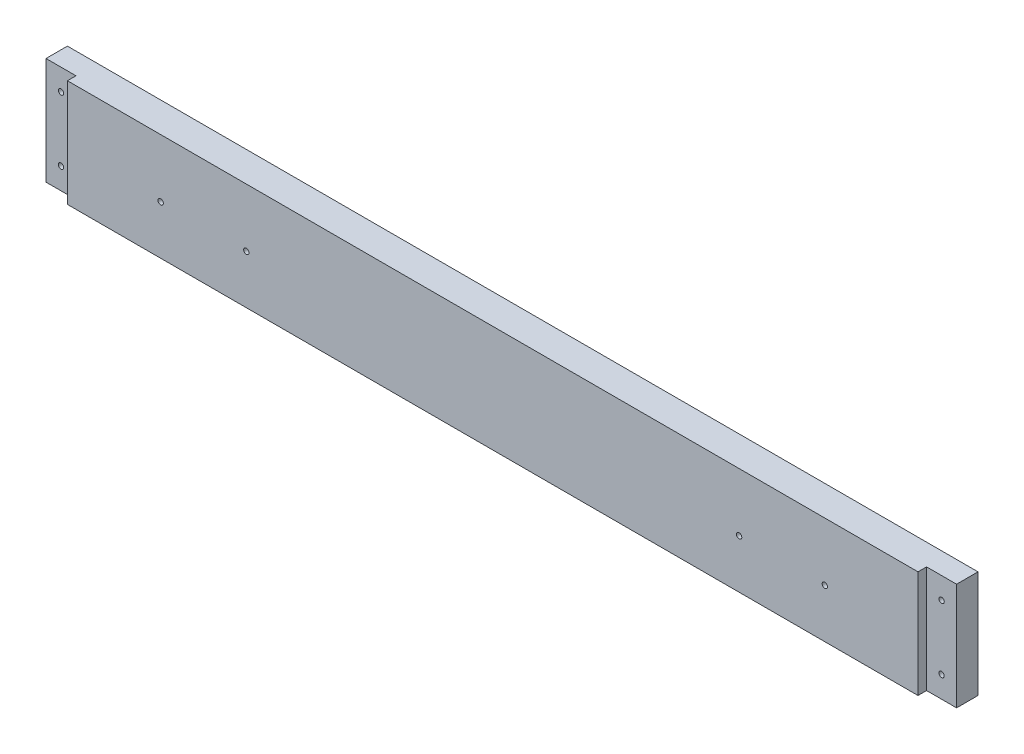
ISO-10303-21;
HEADER;
FILE_DESCRIPTION(('STEP AP214'),'2;1');
FILE_NAME('part.step','',(''),(''),'','','');
FILE_SCHEMA(('AUTOMOTIVE_DESIGN { 1 0 10303 214 1 1 1 1 }'));
ENDSEC;
DATA;
#1=APPLICATION_CONTEXT('core data for automotive mechanical design processes');
#2=APPLICATION_PROTOCOL_DEFINITION('international standard','automotive_design',2000,#1);
#3=PRODUCT_CONTEXT('',#1,'mechanical');
#4=PRODUCT('Part','Part','',(#3));
#5=PRODUCT_RELATED_PRODUCT_CATEGORY('part','',(#4));
#6=PRODUCT_DEFINITION_FORMATION('','',#4);
#7=PRODUCT_DEFINITION_CONTEXT('part definition',#1,'design');
#8=PRODUCT_DEFINITION('design','',#6,#7);
#9=PRODUCT_DEFINITION_SHAPE('','',#8);
#10=(LENGTH_UNIT() NAMED_UNIT(*) SI_UNIT(.MILLI.,.METRE.));
#11=(NAMED_UNIT(*) PLANE_ANGLE_UNIT() SI_UNIT($,.RADIAN.));
#12=(NAMED_UNIT(*) SI_UNIT($,.STERADIAN.) SOLID_ANGLE_UNIT());
#13=UNCERTAINTY_MEASURE_WITH_UNIT(LENGTH_MEASURE(1.E-05),#10,'distance_accuracy_value','');
#14=(GEOMETRIC_REPRESENTATION_CONTEXT(3) GLOBAL_UNCERTAINTY_ASSIGNED_CONTEXT((#13)) GLOBAL_UNIT_ASSIGNED_CONTEXT((#10,
#11,#12)) REPRESENTATION_CONTEXT('',''));
#15=CARTESIAN_POINT('',(0.,0.,0.));
#16=DIRECTION('',(0.,0.,1.));
#17=DIRECTION('',(1.,0.,0.));
#18=AXIS2_PLACEMENT_3D('',#15,#16,#17);
#19=CARTESIAN_POINT('',(10838.3916666658,-5719.7625,-17.78));
#20=DIRECTION('',(0.,-1.,0.));
#21=DIRECTION('',(0.,0.,-1.));
#22=AXIS2_PLACEMENT_3D('',#19,#20,#21);
#23=PLANE('',#22);
#24=DIRECTION('',(0.,0.,1.));
#25=VECTOR('',#24,1.);
#26=CARTESIAN_POINT('',(10856.1716666658,-5719.7625,-5.08));
#27=LINE('',#26,#25);
#28=CARTESIAN_POINT('',(10856.1716666658,-5719.7625,-5.08));
#29=VERTEX_POINT('',#28);
#30=CARTESIAN_POINT('',(10856.1716666658,-5719.7625,0.));
#31=VERTEX_POINT('',#30);
#32=EDGE_CURVE('E47',#29,#31,#27,.T.);
#33=ORIENTED_EDGE('',*,*,#32,.F.);
#34=DIRECTION('',(1.,0.,0.));
#35=VECTOR('',#34,1.);
#36=CARTESIAN_POINT('',(10856.1716666658,-5719.7625,-5.08));
#37=LINE('',#36,#35);
#38=CARTESIAN_POINT('',(10838.3916666658,-5719.7625,-5.08));
#39=VERTEX_POINT('',#38);
#40=EDGE_CURVE('E114',#39,#29,#37,.T.);
#41=ORIENTED_EDGE('',*,*,#40,.F.);
#42=DIRECTION('',(0.,0.,1.));
#43=VECTOR('',#42,1.);
#44=CARTESIAN_POINT('',(10838.3916666658,-5719.7625,-17.78));
#45=LINE('',#44,#43);
#46=CARTESIAN_POINT('',(10838.3916666658,-5719.7625,-17.78));
#47=VERTEX_POINT('',#46);
#48=EDGE_CURVE('E11',#47,#39,#45,.T.);
#49=ORIENTED_EDGE('',*,*,#48,.F.);
#50=DIRECTION('',(1.,0.,0.));
#51=VECTOR('',#50,1.);
#52=CARTESIAN_POINT('',(10838.3916666658,-5719.7625,-17.78));
#53=LINE('',#52,#51);
#54=CARTESIAN_POINT('',(11378.1416666658,-5719.7625,-17.78));
#55=VERTEX_POINT('',#54);
#56=EDGE_CURVE('E178',#47,#55,#53,.T.);
#57=ORIENTED_EDGE('',*,*,#56,.T.);
#58=DIRECTION('',(0.,0.,1.));
#59=VECTOR('',#58,1.);
#60=CARTESIAN_POINT('',(11378.1416666658,-5719.7625,-17.78));
#61=LINE('',#60,#59);
#62=CARTESIAN_POINT('',(11378.1416666658,-5719.7625,-5.08));
#63=VERTEX_POINT('',#62);
#64=EDGE_CURVE('E123',#55,#63,#61,.T.);
#65=ORIENTED_EDGE('',*,*,#64,.T.);
#66=DIRECTION('',(1.,0.,0.));
#67=VECTOR('',#66,1.);
#68=CARTESIAN_POINT('',(11378.1416666658,-5719.7625,-5.08));
#69=LINE('',#68,#67);
#70=CARTESIAN_POINT('',(11360.3616666658,-5719.7625,-5.08));
#71=VERTEX_POINT('',#70);
#72=EDGE_CURVE('E165',#71,#63,#69,.T.);
#73=ORIENTED_EDGE('',*,*,#72,.F.);
#74=DIRECTION('',(0.,0.,1.));
#75=VECTOR('',#74,1.);
#76=CARTESIAN_POINT('',(11360.3616666658,-5719.7625,-5.08));
#77=LINE('',#76,#75);
#78=CARTESIAN_POINT('',(11360.3616666658,-5719.7625,0.));
#79=VERTEX_POINT('',#78);
#80=EDGE_CURVE('E172',#71,#79,#77,.T.);
#81=ORIENTED_EDGE('',*,*,#80,.T.);
#82=DIRECTION('',(1.,0.,0.));
#83=VECTOR('',#82,1.);
#84=CARTESIAN_POINT('',(10838.3916666658,-5719.7625,0.));
#85=LINE('',#84,#83);
#86=EDGE_CURVE('E175',#31,#79,#85,.T.);
#87=ORIENTED_EDGE('',*,*,#86,.F.);
#88=EDGE_LOOP('',(#33,#41,#49,#57,#65,#73,#81,#87));
#89=FACE_BOUND('',#88,.T.);
#90=ADVANCED_FACE('F31',(#89),#23,.T.);
#91=CARTESIAN_POINT('',(10838.3916666658,-5656.2625,-17.78));
#92=DIRECTION('',(-1.,0.,0.));
#93=DIRECTION('',(0.,0.,1.));
#94=AXIS2_PLACEMENT_3D('',#91,#92,#93);
#95=PLANE('',#94);
#96=DIRECTION('',(0.,-1.,0.));
#97=VECTOR('',#96,1.);
#98=CARTESIAN_POINT('',(10838.3916666658,-5719.7625,-5.08));
#99=LINE('',#98,#97);
#100=CARTESIAN_POINT('',(10838.3916666658,-5656.2625,-5.08));
#101=VERTEX_POINT('',#100);
#102=EDGE_CURVE('E102',#101,#39,#99,.T.);
#103=ORIENTED_EDGE('',*,*,#102,.F.);
#104=DIRECTION('',(0.,0.,1.));
#105=VECTOR('',#104,1.);
#106=CARTESIAN_POINT('',(10838.3916666658,-5656.2625,-17.78));
#107=LINE('',#106,#105);
#108=CARTESIAN_POINT('',(10838.3916666658,-5656.2625,-17.78));
#109=VERTEX_POINT('',#108);
#110=EDGE_CURVE('E39',#109,#101,#107,.T.);
#111=ORIENTED_EDGE('',*,*,#110,.F.);
#112=DIRECTION('',(0.,-1.,0.));
#113=VECTOR('',#112,1.);
#114=CARTESIAN_POINT('',(10838.3916666658,-5656.2625,-17.78));
#115=LINE('',#114,#113);
#116=EDGE_CURVE('E129',#109,#47,#115,.T.);
#117=ORIENTED_EDGE('',*,*,#116,.T.);
#118=ORIENTED_EDGE('',*,*,#48,.T.);
#119=EDGE_LOOP('',(#103,#111,#117,#118));
#120=FACE_BOUND('',#119,.T.);
#121=ADVANCED_FACE('F111',(#120),#95,.T.);
#122=CARTESIAN_POINT('',(11378.1416666658,-5656.2625,-17.78));
#123=DIRECTION('',(0.,1.,0.));
#124=DIRECTION('',(0.,0.,1.));
#125=AXIS2_PLACEMENT_3D('',#122,#123,#124);
#126=PLANE('',#125);
#127=DIRECTION('',(0.,0.,1.));
#128=VECTOR('',#127,1.);
#129=CARTESIAN_POINT('',(10856.1716666658,-5656.2625,-5.08));
#130=LINE('',#129,#128);
#131=CARTESIAN_POINT('',(10856.1716666658,-5656.2625,-5.08));
#132=VERTEX_POINT('',#131);
#133=CARTESIAN_POINT('',(10856.1716666658,-5656.2625,0.));
#134=VERTEX_POINT('',#133);
#135=EDGE_CURVE('E158',#132,#134,#130,.T.);
#136=ORIENTED_EDGE('',*,*,#135,.T.);
#137=DIRECTION('',(-1.,0.,0.));
#138=VECTOR('',#137,1.);
#139=CARTESIAN_POINT('',(11378.1416666658,-5656.2625,0.));
#140=LINE('',#139,#138);
#141=CARTESIAN_POINT('',(11360.3616666658,-5656.2625,0.));
#142=VERTEX_POINT('',#141);
#143=EDGE_CURVE('E182',#142,#134,#140,.T.);
#144=ORIENTED_EDGE('',*,*,#143,.F.);
#145=DIRECTION('',(0.,0.,1.));
#146=VECTOR('',#145,1.);
#147=CARTESIAN_POINT('',(11360.3616666658,-5656.2625,-5.08));
#148=LINE('',#147,#146);
#149=CARTESIAN_POINT('',(11360.3616666658,-5656.2625,-5.08));
#150=VERTEX_POINT('',#149);
#151=EDGE_CURVE('E55',#150,#142,#148,.T.);
#152=ORIENTED_EDGE('',*,*,#151,.F.);
#153=DIRECTION('',(-1.,0.,0.));
#154=VECTOR('',#153,1.);
#155=CARTESIAN_POINT('',(11360.3616666658,-5656.2625,-5.08));
#156=LINE('',#155,#154);
#157=CARTESIAN_POINT('',(11378.1416666658,-5656.2625,-5.08));
#158=VERTEX_POINT('',#157);
#159=EDGE_CURVE('E169',#158,#150,#156,.T.);
#160=ORIENTED_EDGE('',*,*,#159,.F.);
#161=DIRECTION('',(0.,0.,1.));
#162=VECTOR('',#161,1.);
#163=CARTESIAN_POINT('',(11378.1416666658,-5656.2625,-17.78));
#164=LINE('',#163,#162);
#165=CARTESIAN_POINT('',(11378.1416666658,-5656.2625,-17.78));
#166=VERTEX_POINT('',#165);
#167=EDGE_CURVE('E120',#166,#158,#164,.T.);
#168=ORIENTED_EDGE('',*,*,#167,.F.);
#169=DIRECTION('',(-1.,0.,0.));
#170=VECTOR('',#169,1.);
#171=CARTESIAN_POINT('',(11378.1416666658,-5656.2625,-17.78));
#172=LINE('',#171,#170);
#173=EDGE_CURVE('E118',#166,#109,#172,.T.);
#174=ORIENTED_EDGE('',*,*,#173,.T.);
#175=ORIENTED_EDGE('',*,*,#110,.T.);
#176=DIRECTION('',(-1.,0.,0.));
#177=VECTOR('',#176,1.);
#178=CARTESIAN_POINT('',(10838.3916666658,-5656.2625,-5.08));
#179=LINE('',#178,#177);
#180=EDGE_CURVE('E99',#132,#101,#179,.T.);
#181=ORIENTED_EDGE('',*,*,#180,.F.);
#182=EDGE_LOOP('',(#136,#144,#152,#160,#168,#174,#175,#181));
#183=FACE_BOUND('',#182,.T.);
#184=ADVANCED_FACE('F116',(#183),#126,.T.);
#185=CARTESIAN_POINT('',(11378.1416666658,-5719.7625,-17.78));
#186=DIRECTION('',(1.,0.,0.));
#187=DIRECTION('',(0.,0.,-1.));
#188=AXIS2_PLACEMENT_3D('',#185,#186,#187);
#189=PLANE('',#188);
#190=DIRECTION('',(0.,1.,0.));
#191=VECTOR('',#190,1.);
#192=CARTESIAN_POINT('',(11378.1416666658,-5656.2625,-5.08));
#193=LINE('',#192,#191);
#194=EDGE_CURVE('E167',#63,#158,#193,.T.);
#195=ORIENTED_EDGE('',*,*,#194,.F.);
#196=ORIENTED_EDGE('',*,*,#64,.F.);
#197=DIRECTION('',(0.,1.,0.));
#198=VECTOR('',#197,1.);
#199=CARTESIAN_POINT('',(11378.1416666658,-5719.7625,-17.78));
#200=LINE('',#199,#198);
#201=EDGE_CURVE('E181',#55,#166,#200,.T.);
#202=ORIENTED_EDGE('',*,*,#201,.T.);
#203=ORIENTED_EDGE('',*,*,#167,.T.);
#204=EDGE_LOOP('',(#195,#196,#202,#203));
#205=FACE_BOUND('',#204,.T.);
#206=ADVANCED_FACE('F203',(#205),#189,.T.);
#207=CARTESIAN_POINT('',(11378.1416666658,-5719.7625,-17.78));
#208=DIRECTION('',(0.,0.,1.));
#209=DIRECTION('',(1.,0.,0.));
#210=AXIS2_PLACEMENT_3D('',#207,#208,#209);
#211=PLANE('',#210);
#212=CARTESIAN_POINT('',(11305.1166666646,-5690.78745,-17.78));
#213=DIRECTION('',(0.,0.,-1.));
#214=DIRECTION('',(-1.,0.,0.));
#215=AXIS2_PLACEMENT_3D('',#212,#213,#214);
#216=CIRCLE('',#215,1.58749999999868);
#217=CARTESIAN_POINT('',(11303.5291666646,-5690.78745,-17.78));
#218=VERTEX_POINT('',#217);
#219=EDGE_CURVE('E361',#218,#218,#216,.T.);
#220=ORIENTED_EDGE('',*,*,#219,.F.);
#221=EDGE_LOOP('',(#220));
#222=FACE_BOUND('',#221,.T.);
#223=CARTESIAN_POINT('',(11254.3166666646,-5690.78745,-17.78));
#224=DIRECTION('',(0.,0.,-1.));
#225=DIRECTION('',(-1.,0.,0.));
#226=AXIS2_PLACEMENT_3D('',#223,#224,#225);
#227=CIRCLE('',#226,1.58749999999868);
#228=CARTESIAN_POINT('',(11252.7291666646,-5690.78745,-17.78));
#229=VERTEX_POINT('',#228);
#230=EDGE_CURVE('E365',#229,#229,#227,.T.);
#231=ORIENTED_EDGE('',*,*,#230,.F.);
#232=EDGE_LOOP('',(#231));
#233=FACE_BOUND('',#232,.T.);
#234=CARTESIAN_POINT('',(10962.2166666646,-5690.78745,-17.78));
#235=DIRECTION('',(0.,0.,-1.));
#236=DIRECTION('',(-1.,0.,0.));
#237=AXIS2_PLACEMENT_3D('',#234,#235,#236);
#238=CIRCLE('',#237,1.58749999999868);
#239=CARTESIAN_POINT('',(10960.6291666646,-5690.78745,-17.78));
#240=VERTEX_POINT('',#239);
#241=EDGE_CURVE('E374',#240,#240,#238,.T.);
#242=ORIENTED_EDGE('',*,*,#241,.F.);
#243=EDGE_LOOP('',(#242));
#244=FACE_BOUND('',#243,.T.);
#245=CARTESIAN_POINT('',(10911.4166666646,-5690.78745,-17.78));
#246=DIRECTION('',(0.,0.,-1.));
#247=DIRECTION('',(-1.,0.,0.));
#248=AXIS2_PLACEMENT_3D('',#245,#246,#247);
#249=CIRCLE('',#248,1.58749999999868);
#250=CARTESIAN_POINT('',(10909.8291666646,-5690.78745,-17.78));
#251=VERTEX_POINT('',#250);
#252=EDGE_CURVE('E380',#251,#251,#249,.T.);
#253=ORIENTED_EDGE('',*,*,#252,.F.);
#254=EDGE_LOOP('',(#253));
#255=FACE_BOUND('',#254,.T.);
#256=CARTESIAN_POINT('',(11369.2516666658,-5668.9625,-17.78));
#257=DIRECTION('',(0.,0.,1.));
#258=DIRECTION('',(1.,0.,0.));
#259=AXIS2_PLACEMENT_3D('',#256,#257,#258);
#260=CIRCLE('',#259,1.58750000000064);
#261=CARTESIAN_POINT('',(11370.8391666658,-5668.9625,-17.78));
#262=VERTEX_POINT('',#261);
#263=EDGE_CURVE('E149',#262,#262,#260,.F.);
#264=ORIENTED_EDGE('',*,*,#263,.F.);
#265=EDGE_LOOP('',(#264));
#266=FACE_BOUND('',#265,.T.);
#267=CARTESIAN_POINT('',(11369.2516666658,-5707.0625,-17.78));
#268=DIRECTION('',(0.,0.,1.));
#269=DIRECTION('',(1.,0.,0.));
#270=AXIS2_PLACEMENT_3D('',#267,#268,#269);
#271=CIRCLE('',#270,1.58750000000064);
#272=CARTESIAN_POINT('',(11370.8391666658,-5707.0625,-17.78));
#273=VERTEX_POINT('',#272);
#274=EDGE_CURVE('E139',#273,#273,#271,.F.);
#275=ORIENTED_EDGE('',*,*,#274,.F.);
#276=EDGE_LOOP('',(#275));
#277=FACE_BOUND('',#276,.T.);
#278=CARTESIAN_POINT('',(10847.2816666658,-5707.0625,-17.78));
#279=DIRECTION('',(0.,0.,1.));
#280=DIRECTION('',(1.,0.,0.));
#281=AXIS2_PLACEMENT_3D('',#278,#279,#280);
#282=CIRCLE('',#281,1.58749999999868);
#283=CARTESIAN_POINT('',(10848.8691666658,-5707.0625,-17.78));
#284=VERTEX_POINT('',#283);
#285=EDGE_CURVE('E136',#284,#284,#282,.F.);
#286=ORIENTED_EDGE('',*,*,#285,.F.);
#287=EDGE_LOOP('',(#286));
#288=FACE_BOUND('',#287,.T.);
#289=CARTESIAN_POINT('',(10847.2816666658,-5668.9625,-17.78));
#290=DIRECTION('',(0.,0.,1.));
#291=DIRECTION('',(1.,0.,0.));
#292=AXIS2_PLACEMENT_3D('',#289,#290,#291);
#293=CIRCLE('',#292,1.58750000000038);
#294=CARTESIAN_POINT('',(10848.8691666658,-5668.9625,-17.78));
#295=VERTEX_POINT('',#294);
#296=EDGE_CURVE('E133',#295,#295,#293,.F.);
#297=ORIENTED_EDGE('',*,*,#296,.F.);
#298=EDGE_LOOP('',(#297));
#299=FACE_BOUND('',#298,.T.);
#300=ORIENTED_EDGE('',*,*,#56,.F.);
#301=ORIENTED_EDGE('',*,*,#116,.F.);
#302=ORIENTED_EDGE('',*,*,#173,.F.);
#303=ORIENTED_EDGE('',*,*,#201,.F.);
#304=EDGE_LOOP('',(#300,#301,#302,#303));
#305=FACE_BOUND('',#304,.T.);
#306=ADVANCED_FACE('F205',(#222,#233,#244,#255,#266,#277,#288,#299,#305),#211,.F.);
#307=CARTESIAN_POINT('',(11378.1416666658,-5719.7625,0.));
#308=DIRECTION('',(0.,0.,1.));
#309=DIRECTION('',(1.,0.,0.));
#310=AXIS2_PLACEMENT_3D('',#307,#308,#309);
#311=PLANE('',#310);
#312=CARTESIAN_POINT('',(11305.1166666646,-5690.78745,0.));
#313=DIRECTION('',(0.,0.,1.));
#314=DIRECTION('',(1.,0.,0.));
#315=AXIS2_PLACEMENT_3D('',#312,#313,#314);
#316=CIRCLE('',#315,1.58749999999868);
#317=CARTESIAN_POINT('',(11306.7041666646,-5690.78745,0.));
#318=VERTEX_POINT('',#317);
#319=EDGE_CURVE('E364',#318,#318,#316,.F.);
#320=ORIENTED_EDGE('',*,*,#319,.T.);
#321=EDGE_LOOP('',(#320));
#322=FACE_BOUND('',#321,.T.);
#323=CARTESIAN_POINT('',(11254.3166666646,-5690.78745,0.));
#324=DIRECTION('',(0.,0.,1.));
#325=DIRECTION('',(1.,0.,0.));
#326=AXIS2_PLACEMENT_3D('',#323,#324,#325);
#327=CIRCLE('',#326,1.58749999999868);
#328=CARTESIAN_POINT('',(11255.9041666646,-5690.78745,0.));
#329=VERTEX_POINT('',#328);
#330=EDGE_CURVE('E368',#329,#329,#327,.F.);
#331=ORIENTED_EDGE('',*,*,#330,.T.);
#332=EDGE_LOOP('',(#331));
#333=FACE_BOUND('',#332,.T.);
#334=CARTESIAN_POINT('',(10962.2166666646,-5690.78745,0.));
#335=DIRECTION('',(0.,0.,1.));
#336=DIRECTION('',(1.,0.,0.));
#337=AXIS2_PLACEMENT_3D('',#334,#335,#336);
#338=CIRCLE('',#337,1.58749999999868);
#339=CARTESIAN_POINT('',(10963.8041666646,-5690.78745,0.));
#340=VERTEX_POINT('',#339);
#341=EDGE_CURVE('E377',#340,#340,#338,.F.);
#342=ORIENTED_EDGE('',*,*,#341,.T.);
#343=EDGE_LOOP('',(#342));
#344=FACE_BOUND('',#343,.T.);
#345=CARTESIAN_POINT('',(10911.4166666646,-5690.78745,0.));
#346=DIRECTION('',(0.,0.,1.));
#347=DIRECTION('',(1.,0.,0.));
#348=AXIS2_PLACEMENT_3D('',#345,#346,#347);
#349=CIRCLE('',#348,1.58749999999868);
#350=CARTESIAN_POINT('',(10913.0041666646,-5690.78745,0.));
#351=VERTEX_POINT('',#350);
#352=EDGE_CURVE('E382',#351,#351,#349,.F.);
#353=ORIENTED_EDGE('',*,*,#352,.T.);
#354=EDGE_LOOP('',(#353));
#355=FACE_BOUND('',#354,.T.);
#356=DIRECTION('',(0.,1.,0.));
#357=VECTOR('',#356,1.);
#358=CARTESIAN_POINT('',(10856.1716666658,-5656.2625,0.));
#359=LINE('',#358,#357);
#360=EDGE_CURVE('E108',#31,#134,#359,.T.);
#361=ORIENTED_EDGE('',*,*,#360,.F.);
#362=ORIENTED_EDGE('',*,*,#86,.T.);
#363=DIRECTION('',(0.,-1.,0.));
#364=VECTOR('',#363,1.);
#365=CARTESIAN_POINT('',(11360.3616666658,-5719.7625,0.));
#366=LINE('',#365,#364);
#367=EDGE_CURVE('E160',#142,#79,#366,.T.);
#368=ORIENTED_EDGE('',*,*,#367,.F.);
#369=ORIENTED_EDGE('',*,*,#143,.T.);
#370=EDGE_LOOP('',(#361,#362,#368,#369));
#371=FACE_BOUND('',#370,.T.);
#372=ADVANCED_FACE('F190',(#322,#333,#344,#355,#371),#311,.T.);
#373=CARTESIAN_POINT('',(11360.3616666658,-5719.7625,-5.08));
#374=DIRECTION('',(-1.,0.,0.));
#375=DIRECTION('',(0.,0.,1.));
#376=AXIS2_PLACEMENT_3D('',#373,#374,#375);
#377=PLANE('',#376);
#378=ORIENTED_EDGE('',*,*,#367,.T.);
#379=ORIENTED_EDGE('',*,*,#80,.F.);
#380=DIRECTION('',(0.,-1.,0.));
#381=VECTOR('',#380,1.);
#382=CARTESIAN_POINT('',(11360.3616666658,-5719.7625,-5.08));
#383=LINE('',#382,#381);
#384=EDGE_CURVE('E162',#150,#71,#383,.T.);
#385=ORIENTED_EDGE('',*,*,#384,.F.);
#386=ORIENTED_EDGE('',*,*,#151,.T.);
#387=EDGE_LOOP('',(#378,#379,#385,#386));
#388=FACE_BOUND('',#387,.T.);
#389=ADVANCED_FACE('F196',(#388),#377,.F.);
#390=CARTESIAN_POINT('',(11360.3616666658,-5656.2625,-5.08));
#391=DIRECTION('',(0.,0.,-1.));
#392=DIRECTION('',(-1.,0.,0.));
#393=AXIS2_PLACEMENT_3D('',#390,#391,#392);
#394=PLANE('',#393);
#395=CARTESIAN_POINT('',(11369.2516666658,-5668.9625,-5.08));
#396=DIRECTION('',(0.,0.,-1.));
#397=DIRECTION('',(-1.,0.,0.));
#398=AXIS2_PLACEMENT_3D('',#395,#396,#397);
#399=CIRCLE('',#398,1.58750000000064);
#400=CARTESIAN_POINT('',(11367.6641666658,-5668.9625,-5.08));
#401=VERTEX_POINT('',#400);
#402=EDGE_CURVE('E34',#401,#401,#399,.T.);
#403=ORIENTED_EDGE('',*,*,#402,.T.);
#404=EDGE_LOOP('',(#403));
#405=FACE_BOUND('',#404,.T.);
#406=CARTESIAN_POINT('',(11369.2516666658,-5707.0625,-5.08));
#407=DIRECTION('',(0.,0.,-1.));
#408=DIRECTION('',(-1.,0.,0.));
#409=AXIS2_PLACEMENT_3D('',#406,#407,#408);
#410=CIRCLE('',#409,1.58750000000064);
#411=CARTESIAN_POINT('',(11367.6641666658,-5707.0625,-5.08));
#412=VERTEX_POINT('',#411);
#413=EDGE_CURVE('E137',#412,#412,#410,.T.);
#414=ORIENTED_EDGE('',*,*,#413,.T.);
#415=EDGE_LOOP('',(#414));
#416=FACE_BOUND('',#415,.T.);
#417=ORIENTED_EDGE('',*,*,#384,.T.);
#418=ORIENTED_EDGE('',*,*,#72,.T.);
#419=ORIENTED_EDGE('',*,*,#194,.T.);
#420=ORIENTED_EDGE('',*,*,#159,.T.);
#421=EDGE_LOOP('',(#417,#418,#419,#420));
#422=FACE_BOUND('',#421,.T.);
#423=ADVANCED_FACE('F198',(#405,#416,#422),#394,.F.);
#424=CARTESIAN_POINT('',(10856.1716666658,-5656.2625,-5.08));
#425=DIRECTION('',(1.,0.,0.));
#426=DIRECTION('',(0.,0.,-1.));
#427=AXIS2_PLACEMENT_3D('',#424,#425,#426);
#428=PLANE('',#427);
#429=ORIENTED_EDGE('',*,*,#360,.T.);
#430=ORIENTED_EDGE('',*,*,#135,.F.);
#431=DIRECTION('',(0.,1.,0.));
#432=VECTOR('',#431,1.);
#433=CARTESIAN_POINT('',(10856.1716666658,-5656.2625,-5.08));
#434=LINE('',#433,#432);
#435=EDGE_CURVE('E104',#29,#132,#434,.T.);
#436=ORIENTED_EDGE('',*,*,#435,.F.);
#437=ORIENTED_EDGE('',*,*,#32,.T.);
#438=EDGE_LOOP('',(#429,#430,#436,#437));
#439=FACE_BOUND('',#438,.T.);
#440=ADVANCED_FACE('F193',(#439),#428,.F.);
#441=CARTESIAN_POINT('',(10856.1716666658,-5656.2625,-5.08));
#442=DIRECTION('',(0.,0.,-1.));
#443=DIRECTION('',(-1.,0.,0.));
#444=AXIS2_PLACEMENT_3D('',#441,#442,#443);
#445=PLANE('',#444);
#446=CARTESIAN_POINT('',(10847.2816666658,-5707.0625,-5.08));
#447=DIRECTION('',(0.,0.,-1.));
#448=DIRECTION('',(-1.,0.,0.));
#449=AXIS2_PLACEMENT_3D('',#446,#447,#448);
#450=CIRCLE('',#449,1.58749999999868);
#451=CARTESIAN_POINT('',(10845.6941666658,-5707.0625,-5.08));
#452=VERTEX_POINT('',#451);
#453=EDGE_CURVE('E134',#452,#452,#450,.T.);
#454=ORIENTED_EDGE('',*,*,#453,.T.);
#455=EDGE_LOOP('',(#454));
#456=FACE_BOUND('',#455,.T.);
#457=CARTESIAN_POINT('',(10847.2816666658,-5668.9625,-5.08));
#458=DIRECTION('',(0.,0.,-1.));
#459=DIRECTION('',(-1.,0.,0.));
#460=AXIS2_PLACEMENT_3D('',#457,#458,#459);
#461=CIRCLE('',#460,1.58750000000038);
#462=CARTESIAN_POINT('',(10845.6941666658,-5668.9625,-5.08));
#463=VERTEX_POINT('',#462);
#464=EDGE_CURVE('E130',#463,#463,#461,.T.);
#465=ORIENTED_EDGE('',*,*,#464,.T.);
#466=EDGE_LOOP('',(#465));
#467=FACE_BOUND('',#466,.T.);
#468=ORIENTED_EDGE('',*,*,#180,.T.);
#469=ORIENTED_EDGE('',*,*,#102,.T.);
#470=ORIENTED_EDGE('',*,*,#40,.T.);
#471=ORIENTED_EDGE('',*,*,#435,.T.);
#472=EDGE_LOOP('',(#468,#469,#470,#471));
#473=FACE_BOUND('',#472,.T.);
#474=ADVANCED_FACE('F101',(#456,#467,#473),#445,.F.);
#475=CARTESIAN_POINT('',(10847.2816666658,-5668.9625,-22.2701280605367));
#476=DIRECTION('',(0.,0.,1.));
#477=DIRECTION('',(1.,0.,0.));
#478=AXIS2_PLACEMENT_3D('',#475,#476,#477);
#479=CYLINDRICAL_SURFACE('',#478,1.58750000000038);
#480=ORIENTED_EDGE('',*,*,#296,.T.);
#481=EDGE_LOOP('',(#480));
#482=FACE_BOUND('',#481,.T.);
#483=ORIENTED_EDGE('',*,*,#464,.F.);
#484=EDGE_LOOP('',(#483));
#485=FACE_BOUND('',#484,.T.);
#486=ADVANCED_FACE('F268',(#482,#485),#479,.F.);
#487=CARTESIAN_POINT('',(10847.2816666658,-5707.0625,-22.2701280605367));
#488=DIRECTION('',(0.,0.,1.));
#489=DIRECTION('',(1.,0.,0.));
#490=AXIS2_PLACEMENT_3D('',#487,#488,#489);
#491=CYLINDRICAL_SURFACE('',#490,1.58749999999868);
#492=ORIENTED_EDGE('',*,*,#285,.T.);
#493=EDGE_LOOP('',(#492));
#494=FACE_BOUND('',#493,.T.);
#495=ORIENTED_EDGE('',*,*,#453,.F.);
#496=EDGE_LOOP('',(#495));
#497=FACE_BOUND('',#496,.T.);
#498=ADVANCED_FACE('F278',(#494,#497),#491,.F.);
#499=CARTESIAN_POINT('',(11369.2516666658,-5707.0625,-22.2701280605367));
#500=DIRECTION('',(0.,0.,1.));
#501=DIRECTION('',(1.,0.,0.));
#502=AXIS2_PLACEMENT_3D('',#499,#500,#501);
#503=CYLINDRICAL_SURFACE('',#502,1.58750000000064);
#504=ORIENTED_EDGE('',*,*,#274,.T.);
#505=EDGE_LOOP('',(#504));
#506=FACE_BOUND('',#505,.T.);
#507=ORIENTED_EDGE('',*,*,#413,.F.);
#508=EDGE_LOOP('',(#507));
#509=FACE_BOUND('',#508,.T.);
#510=ADVANCED_FACE('F288',(#506,#509),#503,.F.);
#511=CARTESIAN_POINT('',(11369.2516666658,-5668.9625,-22.2701280605367));
#512=DIRECTION('',(0.,0.,1.));
#513=DIRECTION('',(1.,0.,0.));
#514=AXIS2_PLACEMENT_3D('',#511,#512,#513);
#515=CYLINDRICAL_SURFACE('',#514,1.58750000000064);
#516=ORIENTED_EDGE('',*,*,#263,.T.);
#517=EDGE_LOOP('',(#516));
#518=FACE_BOUND('',#517,.T.);
#519=ORIENTED_EDGE('',*,*,#402,.F.);
#520=EDGE_LOOP('',(#519));
#521=FACE_BOUND('',#520,.T.);
#522=ADVANCED_FACE('F298',(#518,#521),#515,.F.);
#523=CARTESIAN_POINT('',(10911.4166666646,-5690.78745,4.49012806053164));
#524=DIRECTION('',(0.,0.,-1.));
#525=DIRECTION('',(-1.,0.,0.));
#526=AXIS2_PLACEMENT_3D('',#523,#524,#525);
#527=CYLINDRICAL_SURFACE('',#526,1.58749999999868);
#528=ORIENTED_EDGE('',*,*,#252,.T.);
#529=EDGE_LOOP('',(#528));
#530=FACE_BOUND('',#529,.T.);
#531=ORIENTED_EDGE('',*,*,#352,.F.);
#532=EDGE_LOOP('',(#531));
#533=FACE_BOUND('',#532,.T.);
#534=ADVANCED_FACE('F306',(#530,#533),#527,.F.);
#535=CARTESIAN_POINT('',(10962.2166666646,-5690.78745,4.49012806053164));
#536=DIRECTION('',(0.,0.,-1.));
#537=DIRECTION('',(-1.,0.,0.));
#538=AXIS2_PLACEMENT_3D('',#535,#536,#537);
#539=CYLINDRICAL_SURFACE('',#538,1.58749999999868);
#540=ORIENTED_EDGE('',*,*,#241,.T.);
#541=EDGE_LOOP('',(#540));
#542=FACE_BOUND('',#541,.T.);
#543=ORIENTED_EDGE('',*,*,#341,.F.);
#544=EDGE_LOOP('',(#543));
#545=FACE_BOUND('',#544,.T.);
#546=ADVANCED_FACE('F325',(#542,#545),#539,.F.);
#547=CARTESIAN_POINT('',(11254.3166666646,-5690.78745,4.49012806053164));
#548=DIRECTION('',(0.,0.,-1.));
#549=DIRECTION('',(-1.,0.,0.));
#550=AXIS2_PLACEMENT_3D('',#547,#548,#549);
#551=CYLINDRICAL_SURFACE('',#550,1.58749999999868);
#552=ORIENTED_EDGE('',*,*,#230,.T.);
#553=EDGE_LOOP('',(#552));
#554=FACE_BOUND('',#553,.T.);
#555=ORIENTED_EDGE('',*,*,#330,.F.);
#556=EDGE_LOOP('',(#555));
#557=FACE_BOUND('',#556,.T.);
#558=ADVANCED_FACE('F335',(#554,#557),#551,.F.);
#559=CARTESIAN_POINT('',(11305.1166666646,-5690.78745,4.49012806053164));
#560=DIRECTION('',(0.,0.,-1.));
#561=DIRECTION('',(-1.,0.,0.));
#562=AXIS2_PLACEMENT_3D('',#559,#560,#561);
#563=CYLINDRICAL_SURFACE('',#562,1.58749999999868);
#564=ORIENTED_EDGE('',*,*,#219,.T.);
#565=EDGE_LOOP('',(#564));
#566=FACE_BOUND('',#565,.T.);
#567=ORIENTED_EDGE('',*,*,#319,.F.);
#568=EDGE_LOOP('',(#567));
#569=FACE_BOUND('',#568,.T.);
#570=ADVANCED_FACE('F345',(#566,#569),#563,.F.);
#571=CLOSED_SHELL('',(#90,#121,#184,#206,#306,#372,#389,#423,#440,#474,#486,#498,#510,#522,#534,
#546,#558,#570));
#572=MANIFOLD_SOLID_BREP('B2',#571);
#573=ADVANCED_BREP_SHAPE_REPRESENTATION('',(#18,#572),#14);
#574=SHAPE_DEFINITION_REPRESENTATION(#9,#573);
ENDSEC;
END-ISO-10303-21;
